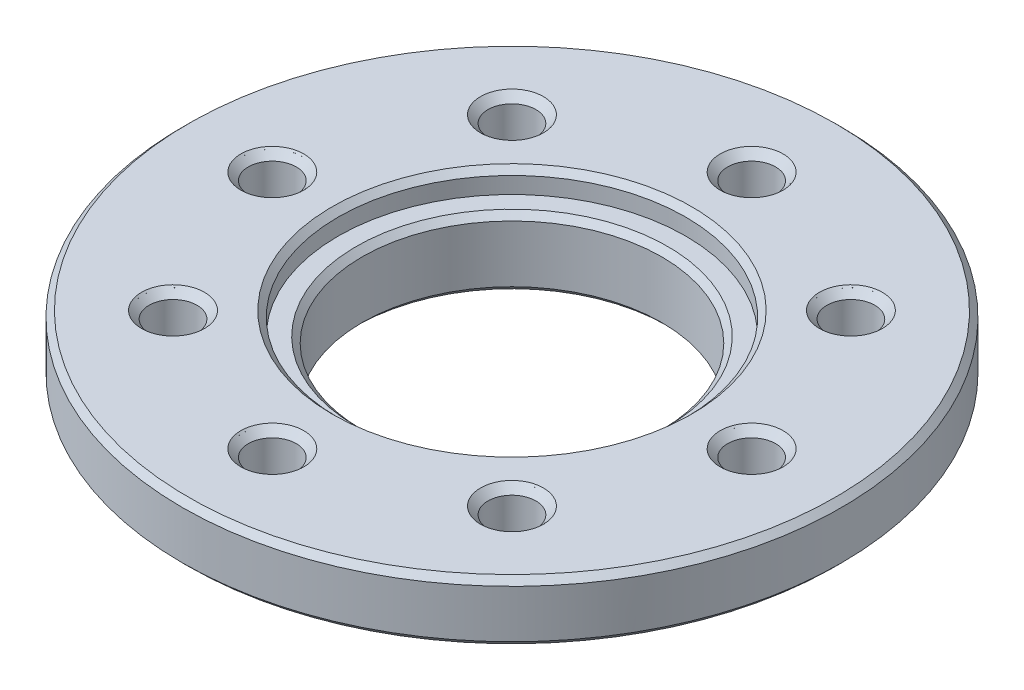
ISO-10303-21;
HEADER;
FILE_DESCRIPTION(('STEP AP214'),'2;1');
FILE_NAME('part.step','',(''),(''),'','','');
FILE_SCHEMA(('AUTOMOTIVE_DESIGN { 1 0 10303 214 1 1 1 1 }'));
ENDSEC;
DATA;
#1=APPLICATION_CONTEXT('core data for automotive mechanical design processes');
#2=APPLICATION_PROTOCOL_DEFINITION('international standard','automotive_design',2000,#1);
#3=PRODUCT_CONTEXT('',#1,'mechanical');
#4=PRODUCT('Part','Part','',(#3));
#5=PRODUCT_RELATED_PRODUCT_CATEGORY('part','',(#4));
#6=PRODUCT_DEFINITION_FORMATION('','',#4);
#7=PRODUCT_DEFINITION_CONTEXT('part definition',#1,'design');
#8=PRODUCT_DEFINITION('design','',#6,#7);
#9=PRODUCT_DEFINITION_SHAPE('','',#8);
#10=(LENGTH_UNIT() NAMED_UNIT(*) SI_UNIT(.MILLI.,.METRE.));
#11=(NAMED_UNIT(*) PLANE_ANGLE_UNIT() SI_UNIT($,.RADIAN.));
#12=(NAMED_UNIT(*) SI_UNIT($,.STERADIAN.) SOLID_ANGLE_UNIT());
#13=UNCERTAINTY_MEASURE_WITH_UNIT(LENGTH_MEASURE(1.E-05),#10,'distance_accuracy_value','');
#14=(GEOMETRIC_REPRESENTATION_CONTEXT(3) GLOBAL_UNCERTAINTY_ASSIGNED_CONTEXT((#13)) GLOBAL_UNIT_ASSIGNED_CONTEXT((#10,
#11,#12)) REPRESENTATION_CONTEXT('',''));
#15=CARTESIAN_POINT('',(0.,0.,0.));
#16=DIRECTION('',(0.,0.,1.));
#17=DIRECTION('',(1.,0.,0.));
#18=AXIS2_PLACEMENT_3D('',#15,#16,#17);
#19=CARTESIAN_POINT('',(5.656854249492,-3.52275,5.656854249492));
#20=DIRECTION('',(0.,1.,0.));
#21=DIRECTION('',(0.,0.,1.));
#22=AXIS2_PLACEMENT_3D('',#19,#20,#21);
#23=CYLINDRICAL_SURFACE('',#22,1.);
#24=CARTESIAN_POINT('',(5.656854249492,-0.0500000000000001,5.656854249492));
#25=DIRECTION('',(0.,1.,0.));
#26=DIRECTION('',(0.,0.,1.));
#27=AXIS2_PLACEMENT_3D('',#24,#25,#26);
#28=CIRCLE('',#27,1.);
#29=CARTESIAN_POINT('',(5.656854249492,-0.0500000000000001,6.656854249492));
#30=VERTEX_POINT('',#29);
#31=EDGE_CURVE('P0_E10',#30,#30,#28,.F.);
#32=ORIENTED_EDGE('',*,*,#31,.T.);
#33=EDGE_LOOP('',(#32));
#34=FACE_BOUND('',#33,.T.);
#35=CARTESIAN_POINT('',(5.656854249492,-2.,5.656854249492));
#36=DIRECTION('',(0.,1.,0.));
#37=DIRECTION('',(0.,0.,1.));
#38=AXIS2_PLACEMENT_3D('',#35,#36,#37);
#39=CIRCLE('',#38,1.);
#40=CARTESIAN_POINT('',(5.656854249492,-2.,6.656854249492));
#41=VERTEX_POINT('',#40);
#42=EDGE_CURVE('P0_E16',#41,#41,#39,.T.);
#43=ORIENTED_EDGE('',*,*,#42,.T.);
#44=EDGE_LOOP('',(#43));
#45=FACE_BOUND('',#44,.T.);
#46=ADVANCED_FACE('P0_F15',(#34,#45),#23,.T.);
#47=OPEN_SHELL('',(#46));
#48=SHELL_BASED_SURFACE_MODEL('P0_B1',(#47));
#49=CARTESIAN_POINT('',(0.,-0.750000000152795,0.));
#50=DIRECTION('',(0.,1.,0.));
#51=DIRECTION('',(0.,0.,1.));
#52=AXIS2_PLACEMENT_3D('',#49,#50,#51);
#53=CONICAL_SURFACE('',#52,5.19999999983156,0.785398163397448);
#54=CARTESIAN_POINT('',(0.,-0.750000000039108,0.));
#55=DIRECTION('',(0.,1.,0.));
#56=DIRECTION('',(0.,0.,1.));
#57=AXIS2_PLACEMENT_3D('',#54,#55,#56);
#58=CIRCLE('',#57,5.19999999994525);
#59=CARTESIAN_POINT('',(0.,-0.750000000039108,5.19999999994525));
#60=VERTEX_POINT('',#59);
#61=EDGE_CURVE('P1_E21',#60,#60,#58,.T.);
#62=ORIENTED_EDGE('',*,*,#61,.T.);
#63=EDGE_LOOP('',(#62));
#64=FACE_BOUND('',#63,.T.);
#65=CARTESIAN_POINT('',(0.,-0.95,0.));
#66=DIRECTION('',(0.,-1.,0.));
#67=DIRECTION('',(0.,0.,-1.));
#68=AXIS2_PLACEMENT_3D('',#65,#66,#67);
#69=CIRCLE('',#68,5.);
#70=CARTESIAN_POINT('',(0.,-0.95,-5.));
#71=VERTEX_POINT('',#70);
#72=EDGE_CURVE('P1_E38',#71,#71,#69,.T.);
#73=ORIENTED_EDGE('',*,*,#72,.T.);
#74=EDGE_LOOP('',(#73));
#75=FACE_BOUND('',#74,.T.);
#76=ADVANCED_FACE('P1_F18',(#64,#75),#53,.F.);
#77=CARTESIAN_POINT('',(0.,-0.75,0.));
#78=DIRECTION('',(0.,-1.,0.));
#79=DIRECTION('',(0.,0.,-1.));
#80=AXIS2_PLACEMENT_3D('',#77,#78,#79);
#81=PLANE('',#80);
#82=ORIENTED_EDGE('',*,*,#61,.F.);
#83=EDGE_LOOP('',(#82));
#84=FACE_BOUND('',#83,.T.);
#85=CARTESIAN_POINT('',(0.,-0.75,0.));
#86=DIRECTION('',(0.,-1.,0.));
#87=DIRECTION('',(0.,0.,-1.));
#88=AXIS2_PLACEMENT_3D('',#85,#86,#87);
#89=CIRCLE('',#88,5.8);
#90=CARTESIAN_POINT('',(0.,-0.75,-5.8));
#91=VERTEX_POINT('',#90);
#92=EDGE_CURVE('P1_E144',#91,#91,#89,.F.);
#93=ORIENTED_EDGE('',*,*,#92,.T.);
#94=EDGE_LOOP('',(#93));
#95=FACE_BOUND('',#94,.T.);
#96=ADVANCED_FACE('P1_F161',(#84,#95),#81,.F.);
#97=CARTESIAN_POINT('',(0.,0.1525,0.));
#98=DIRECTION('',(0.,-1.,0.));
#99=DIRECTION('',(0.,0.,-1.));
#100=AXIS2_PLACEMENT_3D('',#97,#98,#99);
#101=CYLINDRICAL_SURFACE('',#100,5.);
#102=CARTESIAN_POINT('',(0.,-2.84999999996671,0.));
#103=DIRECTION('',(0.,-1.,0.));
#104=DIRECTION('',(-1.,0.,0.));
#105=AXIS2_PLACEMENT_3D('',#102,#103,#104);
#106=CIRCLE('',#105,4.99999999993861);
#107=CARTESIAN_POINT('',(-4.99999999993861,-2.84999999996671,0.));
#108=VERTEX_POINT('',#107);
#109=EDGE_CURVE('P1_E147',#108,#108,#106,.T.);
#110=ORIENTED_EDGE('',*,*,#109,.T.);
#111=EDGE_LOOP('',(#110));
#112=FACE_BOUND('',#111,.T.);
#113=ORIENTED_EDGE('',*,*,#72,.F.);
#114=EDGE_LOOP('',(#113));
#115=FACE_BOUND('',#114,.T.);
#116=ADVANCED_FACE('P1_F163',(#112,#115),#101,.F.);
#117=CARTESIAN_POINT('',(0.,0.1525,0.));
#118=DIRECTION('',(0.,-1.,0.));
#119=DIRECTION('',(0.,0.,-1.));
#120=AXIS2_PLACEMENT_3D('',#117,#118,#119);
#121=CYLINDRICAL_SURFACE('',#120,5.8);
#122=ORIENTED_EDGE('',*,*,#92,.F.);
#123=EDGE_LOOP('',(#122));
#124=FACE_BOUND('',#123,.T.);
#125=CARTESIAN_POINT('',(0.,-0.200000000006639,0.));
#126=DIRECTION('',(0.,1.,0.));
#127=DIRECTION('',(1.,0.,0.));
#128=AXIS2_PLACEMENT_3D('',#125,#126,#127);
#129=CIRCLE('',#128,5.80000000002201);
#130=CARTESIAN_POINT('',(5.80000000002201,-0.200000000006639,0.));
#131=VERTEX_POINT('',#130);
#132=EDGE_CURVE('P1_E143',#131,#131,#129,.T.);
#133=ORIENTED_EDGE('',*,*,#132,.T.);
#134=EDGE_LOOP('',(#133));
#135=FACE_BOUND('',#134,.T.);
#136=ADVANCED_FACE('P1_F169',(#124,#135),#121,.F.);
#137=CARTESIAN_POINT('',(0.,-3.04999999985966,0.));
#138=DIRECTION('',(0.,-1.,0.));
#139=DIRECTION('',(0.,0.,-1.));
#140=AXIS2_PLACEMENT_3D('',#137,#138,#139);
#141=CONICAL_SURFACE('',#140,5.19999999983156,0.785398163397448);
#142=ORIENTED_EDGE('',*,*,#109,.F.);
#143=EDGE_LOOP('',(#142));
#144=FACE_BOUND('',#143,.T.);
#145=CARTESIAN_POINT('',(0.,-3.04999999997335,0.));
#146=DIRECTION('',(0.,-1.,0.));
#147=DIRECTION('',(0.,0.,-1.));
#148=AXIS2_PLACEMENT_3D('',#145,#146,#147);
#149=CIRCLE('',#148,5.19999999994525);
#150=CARTESIAN_POINT('',(0.,-3.04999999997335,-5.19999999994525));
#151=VERTEX_POINT('',#150);
#152=EDGE_CURVE('P1_E140',#151,#151,#149,.F.);
#153=ORIENTED_EDGE('',*,*,#152,.F.);
#154=EDGE_LOOP('',(#153));
#155=FACE_BOUND('',#154,.T.);
#156=ADVANCED_FACE('P1_F274',(#144,#155),#141,.F.);
#157=CARTESIAN_POINT('',(0.,-5.6843418860808E-11,0.));
#158=DIRECTION('',(0.,1.,0.));
#159=DIRECTION('',(0.,0.,1.));
#160=AXIS2_PLACEMENT_3D('',#157,#158,#159);
#161=CONICAL_SURFACE('',#160,5.99999999997181,0.785398163397448);
#162=CARTESIAN_POINT('',(0.,-5.6843418860808E-11,0.));
#163=DIRECTION('',(0.,1.,0.));
#164=DIRECTION('',(0.,0.,1.));
#165=AXIS2_PLACEMENT_3D('',#162,#163,#164);
#166=CIRCLE('',#165,5.99999999997181);
#167=CARTESIAN_POINT('',(0.,-5.6843418860808E-11,5.99999999997181));
#168=VERTEX_POINT('',#167);
#169=EDGE_CURVE('P1_E127',#168,#168,#166,.T.);
#170=ORIENTED_EDGE('',*,*,#169,.T.);
#171=EDGE_LOOP('',(#170));
#172=FACE_BOUND('',#171,.T.);
#173=ORIENTED_EDGE('',*,*,#132,.F.);
#174=EDGE_LOOP('',(#173));
#175=FACE_BOUND('',#174,.T.);
#176=ADVANCED_FACE('P1_F270',(#172,#175),#161,.F.);
#177=CARTESIAN_POINT('',(0.,-0.200000000000015,0.));
#178=DIRECTION('',(0.,-1.,0.));
#179=DIRECTION('',(0.,0.,-1.));
#180=AXIS2_PLACEMENT_3D('',#177,#178,#179);
#181=CONICAL_SURFACE('',#180,11.,0.7853981633973);
#182=CARTESIAN_POINT('',(0.,-0.2,0.));
#183=DIRECTION('',(0.,-1.,0.));
#184=DIRECTION('',(0.,0.,-1.));
#185=AXIS2_PLACEMENT_3D('',#182,#183,#184);
#186=CIRCLE('',#185,11.);
#187=CARTESIAN_POINT('',(0.,-0.2,-11.));
#188=VERTEX_POINT('',#187);
#189=EDGE_CURVE('P1_E126',#188,#188,#186,.T.);
#190=ORIENTED_EDGE('',*,*,#189,.F.);
#191=EDGE_LOOP('',(#190));
#192=FACE_BOUND('',#191,.T.);
#193=CARTESIAN_POINT('',(0.,0.,0.));
#194=DIRECTION('',(0.,-1.,0.));
#195=DIRECTION('',(0.,0.,-1.));
#196=AXIS2_PLACEMENT_3D('',#193,#194,#195);
#197=CIRCLE('',#196,10.8);
#198=CARTESIAN_POINT('',(0.,0.,-10.8));
#199=VERTEX_POINT('',#198);
#200=EDGE_CURVE('P1_E135',#199,#199,#197,.T.);
#201=ORIENTED_EDGE('',*,*,#200,.T.);
#202=EDGE_LOOP('',(#201));
#203=FACE_BOUND('',#202,.T.);
#204=ADVANCED_FACE('P1_F266',(#192,#203),#181,.T.);
#205=CARTESIAN_POINT('',(0.,-3.05,0.));
#206=DIRECTION('',(0.,-1.,0.));
#207=DIRECTION('',(0.,0.,-1.));
#208=AXIS2_PLACEMENT_3D('',#205,#206,#207);
#209=PLANE('',#208);
#210=ORIENTED_EDGE('',*,*,#152,.T.);
#211=EDGE_LOOP('',(#210));
#212=FACE_BOUND('',#211,.T.);
#213=CARTESIAN_POINT('',(0.,-3.0500000000302,0.));
#214=DIRECTION('',(0.,1.,0.));
#215=DIRECTION('',(0.,0.,1.));
#216=AXIS2_PLACEMENT_3D('',#213,#214,#215);
#217=CIRCLE('',#216,6.04999999995925);
#218=CARTESIAN_POINT('',(0.,-3.0500000000302,6.04999999995925));
#219=VERTEX_POINT('',#218);
#220=EDGE_CURVE('P1_E122',#219,#219,#217,.T.);
#221=ORIENTED_EDGE('',*,*,#220,.F.);
#222=EDGE_LOOP('',(#221));
#223=FACE_BOUND('',#222,.T.);
#224=ADVANCED_FACE('P1_F262',(#212,#223),#209,.T.);
#225=CARTESIAN_POINT('',(0.,0.,0.));
#226=DIRECTION('',(0.,-1.,0.));
#227=DIRECTION('',(0.,0.,-1.));
#228=AXIS2_PLACEMENT_3D('',#225,#226,#227);
#229=PLANE('',#228);
#230=CARTESIAN_POINT('',(-5.656854249492,0.,-5.656854249492));
#231=DIRECTION('',(0.,1.,0.));
#232=DIRECTION('',(0.,0.,1.));
#233=AXIS2_PLACEMENT_3D('',#230,#231,#232);
#234=CIRCLE('',#233,1.04999999997565);
#235=CARTESIAN_POINT('',(-5.656854249492,0.,-4.60685424951635));
#236=VERTEX_POINT('',#235);
#237=EDGE_CURVE('P1_E89',#236,#236,#234,.F.);
#238=ORIENTED_EDGE('',*,*,#237,.T.);
#239=EDGE_LOOP('',(#238));
#240=FACE_BOUND('',#239,.T.);
#241=CARTESIAN_POINT('',(-8.,0.,0.));
#242=DIRECTION('',(0.,1.,0.));
#243=DIRECTION('',(0.,0.,1.));
#244=AXIS2_PLACEMENT_3D('',#241,#242,#243);
#245=CIRCLE('',#244,1.05000000003929);
#246=CARTESIAN_POINT('',(-8.,0.,1.05000000003929));
#247=VERTEX_POINT('',#246);
#248=EDGE_CURVE('P1_E94',#247,#247,#245,.F.);
#249=ORIENTED_EDGE('',*,*,#248,.T.);
#250=EDGE_LOOP('',(#249));
#251=FACE_BOUND('',#250,.T.);
#252=CARTESIAN_POINT('',(-5.656854249492,0.,5.656854249492));
#253=DIRECTION('',(0.,1.,0.));
#254=DIRECTION('',(0.,0.,1.));
#255=AXIS2_PLACEMENT_3D('',#252,#253,#254);
#256=CIRCLE('',#255,1.04999999997565);
#257=CARTESIAN_POINT('',(-5.656854249492,0.,6.70685424946765));
#258=VERTEX_POINT('',#257);
#259=EDGE_CURVE('P1_E98',#258,#258,#256,.F.);
#260=ORIENTED_EDGE('',*,*,#259,.T.);
#261=EDGE_LOOP('',(#260));
#262=FACE_BOUND('',#261,.T.);
#263=CARTESIAN_POINT('',(0.,-5.6843418860808E-11,8.));
#264=DIRECTION('',(0.,1.,0.));
#265=DIRECTION('',(0.,0.,1.));
#266=AXIS2_PLACEMENT_3D('',#263,#264,#265);
#267=CIRCLE('',#266,1.04999999990696);
#268=CARTESIAN_POINT('',(0.,-5.6843418860808E-11,9.04999999990696));
#269=VERTEX_POINT('',#268);
#270=EDGE_CURVE('P1_E102',#269,#269,#267,.F.);
#271=ORIENTED_EDGE('',*,*,#270,.T.);
#272=EDGE_LOOP('',(#271));
#273=FACE_BOUND('',#272,.T.);
#274=CARTESIAN_POINT('',(5.656854249492,0.,5.656854249492));
#275=DIRECTION('',(0.,1.,0.));
#276=DIRECTION('',(0.,0.,1.));
#277=AXIS2_PLACEMENT_3D('',#274,#275,#276);
#278=CIRCLE('',#277,1.04999999995195);
#279=CARTESIAN_POINT('',(5.656854249492,0.,6.70685424944395));
#280=VERTEX_POINT('',#279);
#281=EDGE_CURVE('P1_E106',#280,#280,#278,.F.);
#282=ORIENTED_EDGE('',*,*,#281,.T.);
#283=EDGE_LOOP('',(#282));
#284=FACE_BOUND('',#283,.T.);
#285=CARTESIAN_POINT('',(8.,0.,0.));
#286=DIRECTION('',(0.,1.,0.));
#287=DIRECTION('',(0.,0.,1.));
#288=AXIS2_PLACEMENT_3D('',#285,#286,#287);
#289=CIRCLE('',#288,1.050000000002);
#290=CARTESIAN_POINT('',(8.,0.,1.050000000002));
#291=VERTEX_POINT('',#290);
#292=EDGE_CURVE('P1_E110',#291,#291,#289,.F.);
#293=ORIENTED_EDGE('',*,*,#292,.T.);
#294=EDGE_LOOP('',(#293));
#295=FACE_BOUND('',#294,.T.);
#296=CARTESIAN_POINT('',(5.656854249492,0.,-5.656854249492));
#297=DIRECTION('',(0.,1.,0.));
#298=DIRECTION('',(0.,0.,1.));
#299=AXIS2_PLACEMENT_3D('',#296,#297,#298);
#300=CIRCLE('',#299,1.04999999995195);
#301=CARTESIAN_POINT('',(5.656854249492,0.,-4.60685424954005));
#302=VERTEX_POINT('',#301);
#303=EDGE_CURVE('P1_E114',#302,#302,#300,.F.);
#304=ORIENTED_EDGE('',*,*,#303,.T.);
#305=EDGE_LOOP('',(#304));
#306=FACE_BOUND('',#305,.T.);
#307=CARTESIAN_POINT('',(0.,-5.6843418860808E-11,-8.));
#308=DIRECTION('',(0.,1.,0.));
#309=DIRECTION('',(0.,0.,1.));
#310=AXIS2_PLACEMENT_3D('',#307,#308,#309);
#311=CIRCLE('',#310,1.04999999990696);
#312=CARTESIAN_POINT('',(0.,-5.6843418860808E-11,-6.95000000009304));
#313=VERTEX_POINT('',#312);
#314=EDGE_CURVE('P1_E118',#313,#313,#311,.F.);
#315=ORIENTED_EDGE('',*,*,#314,.T.);
#316=EDGE_LOOP('',(#315));
#317=FACE_BOUND('',#316,.T.);
#318=ORIENTED_EDGE('',*,*,#169,.F.);
#319=EDGE_LOOP('',(#318));
#320=FACE_BOUND('',#319,.T.);
#321=ORIENTED_EDGE('',*,*,#200,.F.);
#322=EDGE_LOOP('',(#321));
#323=FACE_BOUND('',#322,.T.);
#324=ADVANCED_FACE('P1_F258',(#240,#251,#262,#273,#284,#295,#306,#317,#320,#323),#229,.F.);
#325=CARTESIAN_POINT('',(0.,0.1525,0.));
#326=DIRECTION('',(0.,-1.,0.));
#327=DIRECTION('',(0.,0.,-1.));
#328=AXIS2_PLACEMENT_3D('',#325,#326,#327);
#329=CYLINDRICAL_SURFACE('',#328,11.);
#330=CARTESIAN_POINT('',(0.,-1.79999999999999,0.));
#331=DIRECTION('',(0.,1.,0.));
#332=DIRECTION('',(1.,0.,0.));
#333=AXIS2_PLACEMENT_3D('',#330,#331,#332);
#334=CIRCLE('',#333,11.);
#335=CARTESIAN_POINT('',(11.,-1.79999999999998,0.));
#336=VERTEX_POINT('',#335);
#337=EDGE_CURVE('P1_E93',#336,#336,#334,.F.);
#338=ORIENTED_EDGE('',*,*,#337,.F.);
#339=EDGE_LOOP('',(#338));
#340=FACE_BOUND('',#339,.T.);
#341=ORIENTED_EDGE('',*,*,#189,.T.);
#342=EDGE_LOOP('',(#341));
#343=FACE_BOUND('',#342,.T.);
#344=ADVANCED_FACE('P1_F254',(#340,#343),#329,.T.);
#345=CARTESIAN_POINT('',(0.,-2.8500000000804,0.));
#346=DIRECTION('',(0.,1.,0.));
#347=DIRECTION('',(0.,0.,1.));
#348=AXIS2_PLACEMENT_3D('',#345,#346,#347);
#349=CONICAL_SURFACE('',#348,6.24999999990905,0.785398163397448);
#350=ORIENTED_EDGE('',*,*,#220,.T.);
#351=EDGE_LOOP('',(#350));
#352=FACE_BOUND('',#351,.T.);
#353=CARTESIAN_POINT('',(0.,-2.85,0.));
#354=DIRECTION('',(0.,-1.,0.));
#355=DIRECTION('',(0.,0.,-1.));
#356=AXIS2_PLACEMENT_3D('',#353,#354,#355);
#357=CIRCLE('',#356,6.25);
#358=CARTESIAN_POINT('',(0.,-2.85,-6.25));
#359=VERTEX_POINT('',#358);
#360=EDGE_CURVE('P1_E298',#359,#359,#357,.F.);
#361=ORIENTED_EDGE('',*,*,#360,.F.);
#362=EDGE_LOOP('',(#361));
#363=FACE_BOUND('',#362,.T.);
#364=ADVANCED_FACE('P1_F250',(#352,#363),#349,.T.);
#365=CARTESIAN_POINT('',(0.,-1.70530256582424E-10,-8.));
#366=DIRECTION('',(0.,1.,0.));
#367=DIRECTION('',(0.,0.,1.));
#368=AXIS2_PLACEMENT_3D('',#365,#366,#367);
#369=CONICAL_SURFACE('',#368,1.04999999979327,0.785398163397448);
#370=CARTESIAN_POINT('',(0.,-0.25,-8.));
#371=DIRECTION('',(0.,1.,0.));
#372=DIRECTION('',(0.,0.,1.));
#373=AXIS2_PLACEMENT_3D('',#370,#371,#372);
#374=CIRCLE('',#373,0.8);
#375=CARTESIAN_POINT('',(0.,-0.25,-7.2));
#376=VERTEX_POINT('',#375);
#377=EDGE_CURVE('P1_E302',#376,#376,#374,.F.);
#378=ORIENTED_EDGE('',*,*,#377,.T.);
#379=EDGE_LOOP('',(#378));
#380=FACE_BOUND('',#379,.T.);
#381=ORIENTED_EDGE('',*,*,#314,.F.);
#382=EDGE_LOOP('',(#381));
#383=FACE_BOUND('',#382,.T.);
#384=ADVANCED_FACE('P1_F246',(#380,#383),#369,.F.);
#385=CARTESIAN_POINT('',(5.656854249492,-5.6843418860808E-11,-5.656854249492));
#386=DIRECTION('',(0.,1.,0.));
#387=DIRECTION('',(0.,0.,1.));
#388=AXIS2_PLACEMENT_3D('',#385,#386,#387);
#389=CONICAL_SURFACE('',#388,1.04999999989511,0.785398163283761);
#390=CARTESIAN_POINT('',(5.656854249492,-0.25,-5.656854249492));
#391=DIRECTION('',(0.,1.,0.));
#392=DIRECTION('',(0.,0.,1.));
#393=AXIS2_PLACEMENT_3D('',#390,#391,#392);
#394=CIRCLE('',#393,0.8);
#395=CARTESIAN_POINT('',(5.656854249492,-0.25,-4.856854249492));
#396=VERTEX_POINT('',#395);
#397=EDGE_CURVE('P1_E306',#396,#396,#394,.F.);
#398=ORIENTED_EDGE('',*,*,#397,.T.);
#399=EDGE_LOOP('',(#398));
#400=FACE_BOUND('',#399,.T.);
#401=ORIENTED_EDGE('',*,*,#303,.F.);
#402=EDGE_LOOP('',(#401));
#403=FACE_BOUND('',#402,.T.);
#404=ADVANCED_FACE('P1_F242',(#400,#403),#389,.F.);
#405=CARTESIAN_POINT('',(8.,-1.13686837721616E-10,0.));
#406=DIRECTION('',(0.,1.,0.));
#407=DIRECTION('',(0.,0.,1.));
#408=AXIS2_PLACEMENT_3D('',#405,#406,#407);
#409=CONICAL_SURFACE('',#408,1.04999999988831,0.785398163397448);
#410=CARTESIAN_POINT('',(8.,-0.25,0.));
#411=DIRECTION('',(0.,1.,0.));
#412=DIRECTION('',(0.,0.,1.));
#413=AXIS2_PLACEMENT_3D('',#410,#411,#412);
#414=CIRCLE('',#413,0.8);
#415=CARTESIAN_POINT('',(8.,-0.25,0.8));
#416=VERTEX_POINT('',#415);
#417=EDGE_CURVE('P1_E310',#416,#416,#414,.F.);
#418=ORIENTED_EDGE('',*,*,#417,.T.);
#419=EDGE_LOOP('',(#418));
#420=FACE_BOUND('',#419,.T.);
#421=ORIENTED_EDGE('',*,*,#292,.F.);
#422=EDGE_LOOP('',(#421));
#423=FACE_BOUND('',#422,.T.);
#424=ADVANCED_FACE('P1_F238',(#420,#423),#409,.F.);
#425=CARTESIAN_POINT('',(5.656854249492,-5.6843418860808E-11,5.656854249492));
#426=DIRECTION('',(0.,1.,0.));
#427=DIRECTION('',(0.,0.,1.));
#428=AXIS2_PLACEMENT_3D('',#425,#426,#427);
#429=CONICAL_SURFACE('',#428,1.04999999989511,0.785398163283761);
#430=CARTESIAN_POINT('',(5.656854249492,-0.25,5.656854249492));
#431=DIRECTION('',(0.,1.,0.));
#432=DIRECTION('',(0.,0.,1.));
#433=AXIS2_PLACEMENT_3D('',#430,#431,#432);
#434=CIRCLE('',#433,0.8);
#435=CARTESIAN_POINT('',(5.656854249492,-0.25,6.456854249492));
#436=VERTEX_POINT('',#435);
#437=EDGE_CURVE('P1_E314',#436,#436,#434,.F.);
#438=ORIENTED_EDGE('',*,*,#437,.T.);
#439=EDGE_LOOP('',(#438));
#440=FACE_BOUND('',#439,.T.);
#441=ORIENTED_EDGE('',*,*,#281,.F.);
#442=EDGE_LOOP('',(#441));
#443=FACE_BOUND('',#442,.T.);
#444=ADVANCED_FACE('P1_F234',(#440,#443),#429,.F.);
#445=CARTESIAN_POINT('',(0.,-1.70530256582424E-10,8.));
#446=DIRECTION('',(0.,1.,0.));
#447=DIRECTION('',(0.,0.,1.));
#448=AXIS2_PLACEMENT_3D('',#445,#446,#447);
#449=CONICAL_SURFACE('',#448,1.04999999979327,0.785398163397448);
#450=CARTESIAN_POINT('',(0.,-0.25,8.));
#451=DIRECTION('',(0.,1.,0.));
#452=DIRECTION('',(0.,0.,1.));
#453=AXIS2_PLACEMENT_3D('',#450,#451,#452);
#454=CIRCLE('',#453,0.8);
#455=CARTESIAN_POINT('',(0.,-0.25,8.8));
#456=VERTEX_POINT('',#455);
#457=EDGE_CURVE('P1_E318',#456,#456,#454,.F.);
#458=ORIENTED_EDGE('',*,*,#457,.T.);
#459=EDGE_LOOP('',(#458));
#460=FACE_BOUND('',#459,.T.);
#461=ORIENTED_EDGE('',*,*,#270,.F.);
#462=EDGE_LOOP('',(#461));
#463=FACE_BOUND('',#462,.T.);
#464=ADVANCED_FACE('P1_F230',(#460,#463),#449,.F.);
#465=CARTESIAN_POINT('',(-5.656854249492,-5.6843418860808E-11,5.656854249492));
#466=DIRECTION('',(0.,1.,0.));
#467=DIRECTION('',(0.,0.,1.));
#468=AXIS2_PLACEMENT_3D('',#465,#466,#467);
#469=CONICAL_SURFACE('',#468,1.04999999991881,0.785398163397448);
#470=CARTESIAN_POINT('',(-5.656854249492,-0.25,5.656854249492));
#471=DIRECTION('',(0.,1.,0.));
#472=DIRECTION('',(0.,0.,1.));
#473=AXIS2_PLACEMENT_3D('',#470,#471,#472);
#474=CIRCLE('',#473,0.8);
#475=CARTESIAN_POINT('',(-5.656854249492,-0.25,6.456854249492));
#476=VERTEX_POINT('',#475);
#477=EDGE_CURVE('P1_E322',#476,#476,#474,.F.);
#478=ORIENTED_EDGE('',*,*,#477,.T.);
#479=EDGE_LOOP('',(#478));
#480=FACE_BOUND('',#479,.T.);
#481=ORIENTED_EDGE('',*,*,#259,.F.);
#482=EDGE_LOOP('',(#481));
#483=FACE_BOUND('',#482,.T.);
#484=ADVANCED_FACE('P1_F226',(#480,#483),#469,.F.);
#485=CARTESIAN_POINT('',(-8.,-5.6843418860808E-11,0.));
#486=DIRECTION('',(0.,1.,0.));
#487=DIRECTION('',(0.,0.,1.));
#488=AXIS2_PLACEMENT_3D('',#485,#486,#487);
#489=CONICAL_SURFACE('',#488,1.04999999998245,0.785398163397448);
#490=CARTESIAN_POINT('',(-8.,-0.25,0.));
#491=DIRECTION('',(0.,1.,0.));
#492=DIRECTION('',(0.,0.,1.));
#493=AXIS2_PLACEMENT_3D('',#490,#491,#492);
#494=CIRCLE('',#493,0.8);
#495=CARTESIAN_POINT('',(-8.,-0.25,0.8));
#496=VERTEX_POINT('',#495);
#497=EDGE_CURVE('P1_E326',#496,#496,#494,.F.);
#498=ORIENTED_EDGE('',*,*,#497,.T.);
#499=EDGE_LOOP('',(#498));
#500=FACE_BOUND('',#499,.T.);
#501=ORIENTED_EDGE('',*,*,#248,.F.);
#502=EDGE_LOOP('',(#501));
#503=FACE_BOUND('',#502,.T.);
#504=ADVANCED_FACE('P1_F222',(#500,#503),#489,.F.);
#505=CARTESIAN_POINT('',(-5.656854249492,-5.6843418860808E-11,-5.656854249492));
#506=DIRECTION('',(0.,1.,0.));
#507=DIRECTION('',(0.,0.,1.));
#508=AXIS2_PLACEMENT_3D('',#505,#506,#507);
#509=CONICAL_SURFACE('',#508,1.04999999991881,0.785398163397448);
#510=CARTESIAN_POINT('',(-5.656854249492,-0.25,-5.656854249492));
#511=DIRECTION('',(0.,1.,0.));
#512=DIRECTION('',(0.,0.,1.));
#513=AXIS2_PLACEMENT_3D('',#510,#511,#512);
#514=CIRCLE('',#513,0.8);
#515=CARTESIAN_POINT('',(-5.656854249492,-0.25,-4.856854249492));
#516=VERTEX_POINT('',#515);
#517=EDGE_CURVE('P1_E88',#516,#516,#514,.F.);
#518=ORIENTED_EDGE('',*,*,#517,.T.);
#519=EDGE_LOOP('',(#518));
#520=FACE_BOUND('',#519,.T.);
#521=ORIENTED_EDGE('',*,*,#237,.F.);
#522=EDGE_LOOP('',(#521));
#523=FACE_BOUND('',#522,.T.);
#524=ADVANCED_FACE('P1_F218',(#520,#523),#509,.F.);
#525=CARTESIAN_POINT('',(0.,-1.79999999999999,0.));
#526=DIRECTION('',(0.,1.,0.));
#527=DIRECTION('',(0.,0.,1.));
#528=AXIS2_PLACEMENT_3D('',#525,#526,#527);
#529=CONICAL_SURFACE('',#528,11.,0.785398163397302);
#530=CARTESIAN_POINT('',(0.,-2.00000000000001,0.));
#531=DIRECTION('',(0.,1.,0.));
#532=DIRECTION('',(0.,0.,1.));
#533=AXIS2_PLACEMENT_3D('',#530,#531,#532);
#534=CIRCLE('',#533,10.8);
#535=CARTESIAN_POINT('',(0.,-2.00000000000001,10.8));
#536=VERTEX_POINT('',#535);
#537=EDGE_CURVE('P1_E84',#536,#536,#534,.F.);
#538=ORIENTED_EDGE('',*,*,#537,.F.);
#539=EDGE_LOOP('',(#538));
#540=FACE_BOUND('',#539,.T.);
#541=ORIENTED_EDGE('',*,*,#337,.T.);
#542=EDGE_LOOP('',(#541));
#543=FACE_BOUND('',#542,.T.);
#544=ADVANCED_FACE('P1_F214',(#540,#543),#529,.T.);
#545=CARTESIAN_POINT('',(0.,0.1525,0.));
#546=DIRECTION('',(0.,-1.,0.));
#547=DIRECTION('',(0.,0.,-1.));
#548=AXIS2_PLACEMENT_3D('',#545,#546,#547);
#549=CYLINDRICAL_SURFACE('',#548,6.25);
#550=CARTESIAN_POINT('',(0.,-2.,0.));
#551=DIRECTION('',(0.,-1.,0.));
#552=DIRECTION('',(0.,0.,-1.));
#553=AXIS2_PLACEMENT_3D('',#550,#551,#552);
#554=CIRCLE('',#553,6.25);
#555=CARTESIAN_POINT('',(0.,-2.,-6.25));
#556=VERTEX_POINT('',#555);
#557=EDGE_CURVE('P1_E80',#556,#556,#554,.F.);
#558=ORIENTED_EDGE('',*,*,#557,.F.);
#559=EDGE_LOOP('',(#558));
#560=FACE_BOUND('',#559,.T.);
#561=ORIENTED_EDGE('',*,*,#360,.T.);
#562=EDGE_LOOP('',(#561));
#563=FACE_BOUND('',#562,.T.);
#564=ADVANCED_FACE('P1_F210',(#560,#563),#549,.T.);
#565=CARTESIAN_POINT('',(0.,-3.52275,-8.));
#566=DIRECTION('',(0.,1.,0.));
#567=DIRECTION('',(0.,0.,1.));
#568=AXIS2_PLACEMENT_3D('',#565,#566,#567);
#569=CYLINDRICAL_SURFACE('',#568,0.8);
#570=ORIENTED_EDGE('',*,*,#377,.F.);
#571=EDGE_LOOP('',(#570));
#572=FACE_BOUND('',#571,.T.);
#573=CARTESIAN_POINT('',(0.,-2.,-8.));
#574=DIRECTION('',(0.,1.,0.));
#575=DIRECTION('',(0.,0.,1.));
#576=AXIS2_PLACEMENT_3D('',#573,#574,#575);
#577=CIRCLE('',#576,0.8);
#578=CARTESIAN_POINT('',(0.,-2.,-7.2));
#579=VERTEX_POINT('',#578);
#580=EDGE_CURVE('P1_E75',#579,#579,#577,.T.);
#581=ORIENTED_EDGE('',*,*,#580,.F.);
#582=EDGE_LOOP('',(#581));
#583=FACE_BOUND('',#582,.T.);
#584=ADVANCED_FACE('P1_F206',(#572,#583),#569,.F.);
#585=CARTESIAN_POINT('',(5.656854249492,-3.52275,-5.656854249492));
#586=DIRECTION('',(0.,1.,0.));
#587=DIRECTION('',(0.,0.,1.));
#588=AXIS2_PLACEMENT_3D('',#585,#586,#587);
#589=CYLINDRICAL_SURFACE('',#588,0.8);
#590=ORIENTED_EDGE('',*,*,#397,.F.);
#591=EDGE_LOOP('',(#590));
#592=FACE_BOUND('',#591,.T.);
#593=CARTESIAN_POINT('',(5.656854249492,-2.,-5.656854249492));
#594=DIRECTION('',(0.,1.,0.));
#595=DIRECTION('',(0.,0.,1.));
#596=AXIS2_PLACEMENT_3D('',#593,#594,#595);
#597=CIRCLE('',#596,0.8);
#598=CARTESIAN_POINT('',(5.656854249492,-2.,-4.856854249492));
#599=VERTEX_POINT('',#598);
#600=EDGE_CURVE('P1_E71',#599,#599,#597,.T.);
#601=ORIENTED_EDGE('',*,*,#600,.F.);
#602=EDGE_LOOP('',(#601));
#603=FACE_BOUND('',#602,.T.);
#604=ADVANCED_FACE('P1_F202',(#592,#603),#589,.F.);
#605=CARTESIAN_POINT('',(8.,-3.52275,0.));
#606=DIRECTION('',(0.,1.,0.));
#607=DIRECTION('',(0.,0.,1.));
#608=AXIS2_PLACEMENT_3D('',#605,#606,#607);
#609=CYLINDRICAL_SURFACE('',#608,0.8);
#610=ORIENTED_EDGE('',*,*,#417,.F.);
#611=EDGE_LOOP('',(#610));
#612=FACE_BOUND('',#611,.T.);
#613=CARTESIAN_POINT('',(8.,-2.,0.));
#614=DIRECTION('',(0.,1.,0.));
#615=DIRECTION('',(0.,0.,1.));
#616=AXIS2_PLACEMENT_3D('',#613,#614,#615);
#617=CIRCLE('',#616,0.8);
#618=CARTESIAN_POINT('',(8.,-2.,0.8));
#619=VERTEX_POINT('',#618);
#620=EDGE_CURVE('P1_E65',#619,#619,#617,.T.);
#621=ORIENTED_EDGE('',*,*,#620,.F.);
#622=EDGE_LOOP('',(#621));
#623=FACE_BOUND('',#622,.T.);
#624=ADVANCED_FACE('P1_F198',(#612,#623),#609,.F.);
#625=CARTESIAN_POINT('',(5.656854249492,-3.52275,5.656854249492));
#626=DIRECTION('',(0.,1.,0.));
#627=DIRECTION('',(0.,0.,1.));
#628=AXIS2_PLACEMENT_3D('',#625,#626,#627);
#629=CYLINDRICAL_SURFACE('',#628,0.8);
#630=ORIENTED_EDGE('',*,*,#437,.F.);
#631=EDGE_LOOP('',(#630));
#632=FACE_BOUND('',#631,.T.);
#633=CARTESIAN_POINT('',(5.656854249492,-2.,5.656854249492));
#634=DIRECTION('',(0.,1.,0.));
#635=DIRECTION('',(0.,0.,1.));
#636=AXIS2_PLACEMENT_3D('',#633,#634,#635);
#637=CIRCLE('',#636,0.8);
#638=CARTESIAN_POINT('',(5.656854249492,-2.,6.456854249492));
#639=VERTEX_POINT('',#638);
#640=EDGE_CURVE('P1_E60',#639,#639,#637,.T.);
#641=ORIENTED_EDGE('',*,*,#640,.F.);
#642=EDGE_LOOP('',(#641));
#643=FACE_BOUND('',#642,.T.);
#644=ADVANCED_FACE('P1_F194',(#632,#643),#629,.F.);
#645=CARTESIAN_POINT('',(0.,-3.52275,8.));
#646=DIRECTION('',(0.,1.,0.));
#647=DIRECTION('',(0.,0.,1.));
#648=AXIS2_PLACEMENT_3D('',#645,#646,#647);
#649=CYLINDRICAL_SURFACE('',#648,0.8);
#650=ORIENTED_EDGE('',*,*,#457,.F.);
#651=EDGE_LOOP('',(#650));
#652=FACE_BOUND('',#651,.T.);
#653=CARTESIAN_POINT('',(0.,-2.,8.));
#654=DIRECTION('',(0.,1.,0.));
#655=DIRECTION('',(0.,0.,1.));
#656=AXIS2_PLACEMENT_3D('',#653,#654,#655);
#657=CIRCLE('',#656,0.8);
#658=CARTESIAN_POINT('',(0.,-2.,8.8));
#659=VERTEX_POINT('',#658);
#660=EDGE_CURVE('P1_E55',#659,#659,#657,.T.);
#661=ORIENTED_EDGE('',*,*,#660,.F.);
#662=EDGE_LOOP('',(#661));
#663=FACE_BOUND('',#662,.T.);
#664=ADVANCED_FACE('P1_F190',(#652,#663),#649,.F.);
#665=CARTESIAN_POINT('',(-5.656854249492,-3.52275,5.656854249492));
#666=DIRECTION('',(0.,1.,0.));
#667=DIRECTION('',(0.,0.,1.));
#668=AXIS2_PLACEMENT_3D('',#665,#666,#667);
#669=CYLINDRICAL_SURFACE('',#668,0.8);
#670=ORIENTED_EDGE('',*,*,#477,.F.);
#671=EDGE_LOOP('',(#670));
#672=FACE_BOUND('',#671,.T.);
#673=CARTESIAN_POINT('',(-5.656854249492,-2.,5.656854249492));
#674=DIRECTION('',(0.,1.,0.));
#675=DIRECTION('',(0.,0.,1.));
#676=AXIS2_PLACEMENT_3D('',#673,#674,#675);
#677=CIRCLE('',#676,0.8);
#678=CARTESIAN_POINT('',(-5.656854249492,-2.,6.456854249492));
#679=VERTEX_POINT('',#678);
#680=EDGE_CURVE('P1_E34',#679,#679,#677,.T.);
#681=ORIENTED_EDGE('',*,*,#680,.F.);
#682=EDGE_LOOP('',(#681));
#683=FACE_BOUND('',#682,.T.);
#684=ADVANCED_FACE('P1_F186',(#672,#683),#669,.F.);
#685=CARTESIAN_POINT('',(-8.,-3.52275,0.));
#686=DIRECTION('',(0.,1.,0.));
#687=DIRECTION('',(0.,0.,1.));
#688=AXIS2_PLACEMENT_3D('',#685,#686,#687);
#689=CYLINDRICAL_SURFACE('',#688,0.8);
#690=ORIENTED_EDGE('',*,*,#497,.F.);
#691=EDGE_LOOP('',(#690));
#692=FACE_BOUND('',#691,.T.);
#693=CARTESIAN_POINT('',(-8.,-2.,0.));
#694=DIRECTION('',(0.,1.,0.));
#695=DIRECTION('',(0.,0.,1.));
#696=AXIS2_PLACEMENT_3D('',#693,#694,#695);
#697=CIRCLE('',#696,0.8);
#698=CARTESIAN_POINT('',(-8.,-2.,0.8));
#699=VERTEX_POINT('',#698);
#700=EDGE_CURVE('P1_E27',#699,#699,#697,.T.);
#701=ORIENTED_EDGE('',*,*,#700,.F.);
#702=EDGE_LOOP('',(#701));
#703=FACE_BOUND('',#702,.T.);
#704=ADVANCED_FACE('P1_F179',(#692,#703),#689,.F.);
#705=CARTESIAN_POINT('',(-5.656854249492,-3.52275,-5.656854249492));
#706=DIRECTION('',(0.,1.,0.));
#707=DIRECTION('',(0.,0.,1.));
#708=AXIS2_PLACEMENT_3D('',#705,#706,#707);
#709=CYLINDRICAL_SURFACE('',#708,0.8);
#710=ORIENTED_EDGE('',*,*,#517,.F.);
#711=EDGE_LOOP('',(#710));
#712=FACE_BOUND('',#711,.T.);
#713=CARTESIAN_POINT('',(-5.656854249492,-2.,-5.656854249492));
#714=DIRECTION('',(0.,1.,0.));
#715=DIRECTION('',(0.,0.,1.));
#716=AXIS2_PLACEMENT_3D('',#713,#714,#715);
#717=CIRCLE('',#716,0.8);
#718=CARTESIAN_POINT('',(-5.656854249492,-2.,-4.856854249492));
#719=VERTEX_POINT('',#718);
#720=EDGE_CURVE('P1_E11',#719,#719,#717,.T.);
#721=ORIENTED_EDGE('',*,*,#720,.F.);
#722=EDGE_LOOP('',(#721));
#723=FACE_BOUND('',#722,.T.);
#724=ADVANCED_FACE('P1_F174',(#712,#723),#709,.F.);
#725=CARTESIAN_POINT('',(0.,-2.,0.));
#726=DIRECTION('',(0.,-1.,0.));
#727=DIRECTION('',(0.,0.,-1.));
#728=AXIS2_PLACEMENT_3D('',#725,#726,#727);
#729=PLANE('',#728);
#730=ORIENTED_EDGE('',*,*,#720,.T.);
#731=EDGE_LOOP('',(#730));
#732=FACE_BOUND('',#731,.T.);
#733=ORIENTED_EDGE('',*,*,#700,.T.);
#734=EDGE_LOOP('',(#733));
#735=FACE_BOUND('',#734,.T.);
#736=ORIENTED_EDGE('',*,*,#680,.T.);
#737=EDGE_LOOP('',(#736));
#738=FACE_BOUND('',#737,.T.);
#739=ORIENTED_EDGE('',*,*,#660,.T.);
#740=EDGE_LOOP('',(#739));
#741=FACE_BOUND('',#740,.T.);
#742=ORIENTED_EDGE('',*,*,#640,.T.);
#743=EDGE_LOOP('',(#742));
#744=FACE_BOUND('',#743,.T.);
#745=ORIENTED_EDGE('',*,*,#620,.T.);
#746=EDGE_LOOP('',(#745));
#747=FACE_BOUND('',#746,.T.);
#748=ORIENTED_EDGE('',*,*,#600,.T.);
#749=EDGE_LOOP('',(#748));
#750=FACE_BOUND('',#749,.T.);
#751=ORIENTED_EDGE('',*,*,#580,.T.);
#752=EDGE_LOOP('',(#751));
#753=FACE_BOUND('',#752,.T.);
#754=ORIENTED_EDGE('',*,*,#557,.T.);
#755=EDGE_LOOP('',(#754));
#756=FACE_BOUND('',#755,.T.);
#757=ORIENTED_EDGE('',*,*,#537,.T.);
#758=EDGE_LOOP('',(#757));
#759=FACE_BOUND('',#758,.T.);
#760=ADVANCED_FACE('P1_F172',(#732,#735,#738,#741,#744,#747,#750,#753,#756,#759),#729,.T.);
#761=CLOSED_SHELL('',(#76,#96,#116,#136,#156,#176,#204,#224,#324,#344,#364,#384,#404,#424,#444,
#464,#484,#504,#524,#544,#564,#584,#604,#624,#644,#664,#684,#704,#724,#760));
#762=MANIFOLD_SOLID_BREP('P1_B1',#761);
#763=CARTESIAN_POINT('',(8.,-3.52275,0.));
#764=DIRECTION('',(0.,1.,0.));
#765=DIRECTION('',(0.,0.,1.));
#766=AXIS2_PLACEMENT_3D('',#763,#764,#765);
#767=CYLINDRICAL_SURFACE('',#766,1.);
#768=CARTESIAN_POINT('',(8.,-0.0500000000000001,0.));
#769=DIRECTION('',(0.,1.,0.));
#770=DIRECTION('',(0.,0.,1.));
#771=AXIS2_PLACEMENT_3D('',#768,#769,#770);
#772=CIRCLE('',#771,1.);
#773=CARTESIAN_POINT('',(8.,-0.0500000000000001,1.));
#774=VERTEX_POINT('',#773);
#775=EDGE_CURVE('P2_E10',#774,#774,#772,.F.);
#776=ORIENTED_EDGE('',*,*,#775,.T.);
#777=EDGE_LOOP('',(#776));
#778=FACE_BOUND('',#777,.T.);
#779=CARTESIAN_POINT('',(8.,-2.,0.));
#780=DIRECTION('',(0.,1.,0.));
#781=DIRECTION('',(0.,0.,1.));
#782=AXIS2_PLACEMENT_3D('',#779,#780,#781);
#783=CIRCLE('',#782,1.);
#784=CARTESIAN_POINT('',(8.,-2.,1.));
#785=VERTEX_POINT('',#784);
#786=EDGE_CURVE('P2_E16',#785,#785,#783,.T.);
#787=ORIENTED_EDGE('',*,*,#786,.T.);
#788=EDGE_LOOP('',(#787));
#789=FACE_BOUND('',#788,.T.);
#790=ADVANCED_FACE('P2_F15',(#778,#789),#767,.T.);
#791=OPEN_SHELL('',(#790));
#792=SHELL_BASED_SURFACE_MODEL('P2_B1',(#791));
#793=CARTESIAN_POINT('',(5.656854249492,-3.52275,-5.656854249492));
#794=DIRECTION('',(0.,1.,0.));
#795=DIRECTION('',(0.,0.,1.));
#796=AXIS2_PLACEMENT_3D('',#793,#794,#795);
#797=CYLINDRICAL_SURFACE('',#796,1.);
#798=CARTESIAN_POINT('',(5.656854249492,-0.0500000000000001,-5.656854249492));
#799=DIRECTION('',(0.,1.,0.));
#800=DIRECTION('',(0.,0.,1.));
#801=AXIS2_PLACEMENT_3D('',#798,#799,#800);
#802=CIRCLE('',#801,1.);
#803=CARTESIAN_POINT('',(5.656854249492,-0.0500000000000001,-4.656854249492));
#804=VERTEX_POINT('',#803);
#805=EDGE_CURVE('P3_E10',#804,#804,#802,.F.);
#806=ORIENTED_EDGE('',*,*,#805,.T.);
#807=EDGE_LOOP('',(#806));
#808=FACE_BOUND('',#807,.T.);
#809=CARTESIAN_POINT('',(5.656854249492,-2.,-5.656854249492));
#810=DIRECTION('',(0.,1.,0.));
#811=DIRECTION('',(0.,0.,1.));
#812=AXIS2_PLACEMENT_3D('',#809,#810,#811);
#813=CIRCLE('',#812,1.);
#814=CARTESIAN_POINT('',(5.656854249492,-2.,-4.656854249492));
#815=VERTEX_POINT('',#814);
#816=EDGE_CURVE('P3_E16',#815,#815,#813,.T.);
#817=ORIENTED_EDGE('',*,*,#816,.T.);
#818=EDGE_LOOP('',(#817));
#819=FACE_BOUND('',#818,.T.);
#820=ADVANCED_FACE('P3_F15',(#808,#819),#797,.T.);
#821=OPEN_SHELL('',(#820));
#822=SHELL_BASED_SURFACE_MODEL('P3_B1',(#821));
#823=CARTESIAN_POINT('',(-8.,-3.52275,0.));
#824=DIRECTION('',(0.,1.,0.));
#825=DIRECTION('',(0.,0.,1.));
#826=AXIS2_PLACEMENT_3D('',#823,#824,#825);
#827=CYLINDRICAL_SURFACE('',#826,1.);
#828=CARTESIAN_POINT('',(-8.,-0.0500000000000001,0.));
#829=DIRECTION('',(0.,1.,0.));
#830=DIRECTION('',(0.,0.,1.));
#831=AXIS2_PLACEMENT_3D('',#828,#829,#830);
#832=CIRCLE('',#831,1.);
#833=CARTESIAN_POINT('',(-8.,-0.0500000000000001,1.));
#834=VERTEX_POINT('',#833);
#835=EDGE_CURVE('P4_E10',#834,#834,#832,.F.);
#836=ORIENTED_EDGE('',*,*,#835,.T.);
#837=EDGE_LOOP('',(#836));
#838=FACE_BOUND('',#837,.T.);
#839=CARTESIAN_POINT('',(-8.,-2.,0.));
#840=DIRECTION('',(0.,1.,0.));
#841=DIRECTION('',(0.,0.,1.));
#842=AXIS2_PLACEMENT_3D('',#839,#840,#841);
#843=CIRCLE('',#842,1.);
#844=CARTESIAN_POINT('',(-8.,-2.,1.));
#845=VERTEX_POINT('',#844);
#846=EDGE_CURVE('P4_E16',#845,#845,#843,.T.);
#847=ORIENTED_EDGE('',*,*,#846,.T.);
#848=EDGE_LOOP('',(#847));
#849=FACE_BOUND('',#848,.T.);
#850=ADVANCED_FACE('P4_F15',(#838,#849),#827,.T.);
#851=OPEN_SHELL('',(#850));
#852=SHELL_BASED_SURFACE_MODEL('P4_B1',(#851));
#853=CARTESIAN_POINT('',(0.,-3.52275,-8.));
#854=DIRECTION('',(0.,1.,0.));
#855=DIRECTION('',(0.,0.,1.));
#856=AXIS2_PLACEMENT_3D('',#853,#854,#855);
#857=CYLINDRICAL_SURFACE('',#856,1.);
#858=CARTESIAN_POINT('',(0.,-0.0500000000000001,-8.));
#859=DIRECTION('',(0.,1.,0.));
#860=DIRECTION('',(0.,0.,1.));
#861=AXIS2_PLACEMENT_3D('',#858,#859,#860);
#862=CIRCLE('',#861,1.);
#863=CARTESIAN_POINT('',(0.,-0.0500000000000001,-7.));
#864=VERTEX_POINT('',#863);
#865=EDGE_CURVE('P5_E10',#864,#864,#862,.F.);
#866=ORIENTED_EDGE('',*,*,#865,.T.);
#867=EDGE_LOOP('',(#866));
#868=FACE_BOUND('',#867,.T.);
#869=CARTESIAN_POINT('',(0.,-2.,-8.));
#870=DIRECTION('',(0.,1.,0.));
#871=DIRECTION('',(0.,0.,1.));
#872=AXIS2_PLACEMENT_3D('',#869,#870,#871);
#873=CIRCLE('',#872,1.);
#874=CARTESIAN_POINT('',(0.,-2.,-7.));
#875=VERTEX_POINT('',#874);
#876=EDGE_CURVE('P5_E16',#875,#875,#873,.T.);
#877=ORIENTED_EDGE('',*,*,#876,.T.);
#878=EDGE_LOOP('',(#877));
#879=FACE_BOUND('',#878,.T.);
#880=ADVANCED_FACE('P5_F15',(#868,#879),#857,.T.);
#881=OPEN_SHELL('',(#880));
#882=SHELL_BASED_SURFACE_MODEL('P5_B1',(#881));
#883=CARTESIAN_POINT('',(-5.656854249492,-3.52275,5.656854249492));
#884=DIRECTION('',(0.,1.,0.));
#885=DIRECTION('',(0.,0.,1.));
#886=AXIS2_PLACEMENT_3D('',#883,#884,#885);
#887=CYLINDRICAL_SURFACE('',#886,1.);
#888=CARTESIAN_POINT('',(-5.656854249492,-0.0500000000000001,5.656854249492));
#889=DIRECTION('',(0.,1.,0.));
#890=DIRECTION('',(0.,0.,1.));
#891=AXIS2_PLACEMENT_3D('',#888,#889,#890);
#892=CIRCLE('',#891,1.);
#893=CARTESIAN_POINT('',(-5.656854249492,-0.0500000000000001,6.656854249492));
#894=VERTEX_POINT('',#893);
#895=EDGE_CURVE('P6_E10',#894,#894,#892,.F.);
#896=ORIENTED_EDGE('',*,*,#895,.T.);
#897=EDGE_LOOP('',(#896));
#898=FACE_BOUND('',#897,.T.);
#899=CARTESIAN_POINT('',(-5.656854249492,-2.,5.656854249492));
#900=DIRECTION('',(0.,1.,0.));
#901=DIRECTION('',(0.,0.,1.));
#902=AXIS2_PLACEMENT_3D('',#899,#900,#901);
#903=CIRCLE('',#902,1.);
#904=CARTESIAN_POINT('',(-5.656854249492,-2.,6.656854249492));
#905=VERTEX_POINT('',#904);
#906=EDGE_CURVE('P6_E16',#905,#905,#903,.T.);
#907=ORIENTED_EDGE('',*,*,#906,.T.);
#908=EDGE_LOOP('',(#907));
#909=FACE_BOUND('',#908,.T.);
#910=ADVANCED_FACE('P6_F15',(#898,#909),#887,.T.);
#911=OPEN_SHELL('',(#910));
#912=SHELL_BASED_SURFACE_MODEL('P6_B1',(#911));
#913=CARTESIAN_POINT('',(0.,-3.52275,8.));
#914=DIRECTION('',(0.,1.,0.));
#915=DIRECTION('',(0.,0.,1.));
#916=AXIS2_PLACEMENT_3D('',#913,#914,#915);
#917=CYLINDRICAL_SURFACE('',#916,1.);
#918=CARTESIAN_POINT('',(0.,-0.0500000000000001,8.));
#919=DIRECTION('',(0.,1.,0.));
#920=DIRECTION('',(0.,0.,1.));
#921=AXIS2_PLACEMENT_3D('',#918,#919,#920);
#922=CIRCLE('',#921,1.);
#923=CARTESIAN_POINT('',(0.,-0.0500000000000001,9.));
#924=VERTEX_POINT('',#923);
#925=EDGE_CURVE('P7_E10',#924,#924,#922,.F.);
#926=ORIENTED_EDGE('',*,*,#925,.T.);
#927=EDGE_LOOP('',(#926));
#928=FACE_BOUND('',#927,.T.);
#929=CARTESIAN_POINT('',(0.,-2.,8.));
#930=DIRECTION('',(0.,1.,0.));
#931=DIRECTION('',(0.,0.,1.));
#932=AXIS2_PLACEMENT_3D('',#929,#930,#931);
#933=CIRCLE('',#932,1.);
#934=CARTESIAN_POINT('',(0.,-2.,9.));
#935=VERTEX_POINT('',#934);
#936=EDGE_CURVE('P7_E16',#935,#935,#933,.T.);
#937=ORIENTED_EDGE('',*,*,#936,.T.);
#938=EDGE_LOOP('',(#937));
#939=FACE_BOUND('',#938,.T.);
#940=ADVANCED_FACE('P7_F15',(#928,#939),#917,.T.);
#941=OPEN_SHELL('',(#940));
#942=SHELL_BASED_SURFACE_MODEL('P7_B1',(#941));
#943=CARTESIAN_POINT('',(-5.656854249492,-3.52275,-5.656854249492));
#944=DIRECTION('',(0.,1.,0.));
#945=DIRECTION('',(0.,0.,1.));
#946=AXIS2_PLACEMENT_3D('',#943,#944,#945);
#947=CYLINDRICAL_SURFACE('',#946,1.);
#948=CARTESIAN_POINT('',(-5.656854249492,-0.0500000000000001,-5.656854249492));
#949=DIRECTION('',(0.,1.,0.));
#950=DIRECTION('',(0.,0.,1.));
#951=AXIS2_PLACEMENT_3D('',#948,#949,#950);
#952=CIRCLE('',#951,1.);
#953=CARTESIAN_POINT('',(-5.656854249492,-0.0500000000000001,-4.656854249492));
#954=VERTEX_POINT('',#953);
#955=EDGE_CURVE('P8_E10',#954,#954,#952,.F.);
#956=ORIENTED_EDGE('',*,*,#955,.T.);
#957=EDGE_LOOP('',(#956));
#958=FACE_BOUND('',#957,.T.);
#959=CARTESIAN_POINT('',(-5.656854249492,-2.,-5.656854249492));
#960=DIRECTION('',(0.,1.,0.));
#961=DIRECTION('',(0.,0.,1.));
#962=AXIS2_PLACEMENT_3D('',#959,#960,#961);
#963=CIRCLE('',#962,1.);
#964=CARTESIAN_POINT('',(-5.656854249492,-2.,-4.656854249492));
#965=VERTEX_POINT('',#964);
#966=EDGE_CURVE('P8_E16',#965,#965,#963,.T.);
#967=ORIENTED_EDGE('',*,*,#966,.T.);
#968=EDGE_LOOP('',(#967));
#969=FACE_BOUND('',#968,.T.);
#970=ADVANCED_FACE('P8_F15',(#958,#969),#947,.T.);
#971=OPEN_SHELL('',(#970));
#972=SHELL_BASED_SURFACE_MODEL('P8_B1',(#971));
#973=ADVANCED_BREP_SHAPE_REPRESENTATION('',(#18,#762),#14);
#974=MANIFOLD_SURFACE_SHAPE_REPRESENTATION('',(#18,#48,#792,#822,#852,#882,#912,#942,#972),#14);
#975=SHAPE_REPRESENTATION('',(#18),#14);
#976=SHAPE_DEFINITION_REPRESENTATION(#9,#975);
#977=SHAPE_REPRESENTATION_RELATIONSHIP('','',#975,#973);
#978=SHAPE_REPRESENTATION_RELATIONSHIP('','',#975,#974);
ENDSEC;
END-ISO-10303-21;
